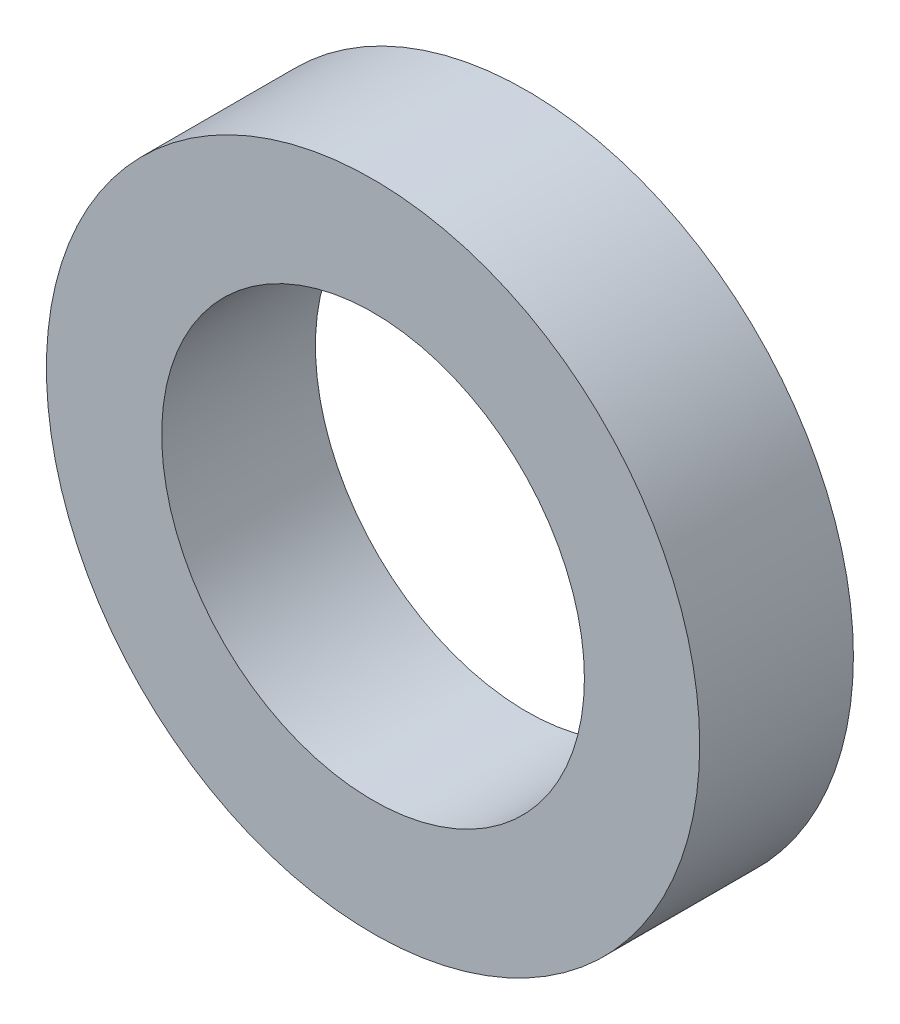
ISO-10303-21;
HEADER;
FILE_DESCRIPTION(('STEP AP214'),'2;1');
FILE_NAME('part.step','',(''),(''),'','','');
FILE_SCHEMA(('AUTOMOTIVE_DESIGN { 1 0 10303 214 1 1 1 1 }'));
ENDSEC;
DATA;
#1=APPLICATION_CONTEXT('core data for automotive mechanical design processes');
#2=APPLICATION_PROTOCOL_DEFINITION('international standard','automotive_design',2000,#1);
#3=PRODUCT_CONTEXT('',#1,'mechanical');
#4=PRODUCT('Part','Part','',(#3));
#5=PRODUCT_RELATED_PRODUCT_CATEGORY('part','',(#4));
#6=PRODUCT_DEFINITION_FORMATION('','',#4);
#7=PRODUCT_DEFINITION_CONTEXT('part definition',#1,'design');
#8=PRODUCT_DEFINITION('design','',#6,#7);
#9=PRODUCT_DEFINITION_SHAPE('','',#8);
#10=(LENGTH_UNIT() NAMED_UNIT(*) SI_UNIT(.MILLI.,.METRE.));
#11=(NAMED_UNIT(*) PLANE_ANGLE_UNIT() SI_UNIT($,.RADIAN.));
#12=(NAMED_UNIT(*) SI_UNIT($,.STERADIAN.) SOLID_ANGLE_UNIT());
#13=UNCERTAINTY_MEASURE_WITH_UNIT(LENGTH_MEASURE(1.E-05),#10,'distance_accuracy_value','');
#14=(GEOMETRIC_REPRESENTATION_CONTEXT(3) GLOBAL_UNCERTAINTY_ASSIGNED_CONTEXT((#13)) GLOBAL_UNIT_ASSIGNED_CONTEXT((#10,
#11,#12)) REPRESENTATION_CONTEXT('',''));
#15=CARTESIAN_POINT('',(0.,0.,0.));
#16=DIRECTION('',(0.,0.,1.));
#17=DIRECTION('',(1.,0.,0.));
#18=AXIS2_PLACEMENT_3D('',#15,#16,#17);
#19=CARTESIAN_POINT('',(0.,0.,2.));
#20=DIRECTION('',(0.,0.,1.));
#21=DIRECTION('',(1.,0.,0.));
#22=AXIS2_PLACEMENT_3D('',#19,#20,#21);
#23=PLANE('',#22);
#24=CARTESIAN_POINT('',(0.,0.,2.));
#25=DIRECTION('',(0.,0.,1.));
#26=DIRECTION('',(1.,0.,0.));
#27=AXIS2_PLACEMENT_3D('',#24,#25,#26);
#28=CIRCLE('',#27,4.25);
#29=CARTESIAN_POINT('',(4.25,0.,2.));
#30=VERTEX_POINT('',#29);
#31=EDGE_CURVE('E10',#30,#30,#28,.T.);
#32=ORIENTED_EDGE('',*,*,#31,.T.);
#33=EDGE_LOOP('',(#32));
#34=FACE_BOUND('',#33,.T.);
#35=CARTESIAN_POINT('',(0.,0.,2.));
#36=DIRECTION('',(0.,0.,1.));
#37=DIRECTION('',(1.,0.,0.));
#38=AXIS2_PLACEMENT_3D('',#35,#36,#37);
#39=CIRCLE('',#38,2.75);
#40=CARTESIAN_POINT('',(2.75,0.,2.));
#41=VERTEX_POINT('',#40);
#42=EDGE_CURVE('E42',#41,#41,#39,.T.);
#43=ORIENTED_EDGE('',*,*,#42,.F.);
#44=EDGE_LOOP('',(#43));
#45=FACE_BOUND('',#44,.T.);
#46=ADVANCED_FACE('F31',(#34,#45),#23,.T.);
#47=CARTESIAN_POINT('',(0.,0.,0.));
#48=DIRECTION('',(0.,0.,1.));
#49=DIRECTION('',(1.,0.,0.));
#50=AXIS2_PLACEMENT_3D('',#47,#48,#49);
#51=PLANE('',#50);
#52=CARTESIAN_POINT('',(0.,0.,0.));
#53=DIRECTION('',(0.,0.,1.));
#54=DIRECTION('',(1.,0.,0.));
#55=AXIS2_PLACEMENT_3D('',#52,#53,#54);
#56=CIRCLE('',#55,4.25);
#57=CARTESIAN_POINT('',(4.25,0.,0.));
#58=VERTEX_POINT('',#57);
#59=EDGE_CURVE('E35',#58,#58,#56,.T.);
#60=ORIENTED_EDGE('',*,*,#59,.F.);
#61=EDGE_LOOP('',(#60));
#62=FACE_BOUND('',#61,.T.);
#63=CARTESIAN_POINT('',(0.,0.,0.));
#64=DIRECTION('',(0.,0.,1.));
#65=DIRECTION('',(1.,0.,0.));
#66=AXIS2_PLACEMENT_3D('',#63,#64,#65);
#67=CIRCLE('',#66,2.75);
#68=CARTESIAN_POINT('',(2.75,0.,0.));
#69=VERTEX_POINT('',#68);
#70=EDGE_CURVE('E44',#69,#69,#67,.T.);
#71=ORIENTED_EDGE('',*,*,#70,.T.);
#72=EDGE_LOOP('',(#71));
#73=FACE_BOUND('',#72,.T.);
#74=ADVANCED_FACE('F54',(#62,#73),#51,.F.);
#75=CARTESIAN_POINT('',(0.,0.,2.));
#76=DIRECTION('',(0.,0.,-1.));
#77=DIRECTION('',(-1.,0.,0.));
#78=AXIS2_PLACEMENT_3D('',#75,#76,#77);
#79=CYLINDRICAL_SURFACE('',#78,4.25);
#80=ORIENTED_EDGE('',*,*,#31,.F.);
#81=EDGE_LOOP('',(#80));
#82=FACE_BOUND('',#81,.T.);
#83=ORIENTED_EDGE('',*,*,#59,.T.);
#84=EDGE_LOOP('',(#83));
#85=FACE_BOUND('',#84,.T.);
#86=ADVANCED_FACE('F33',(#82,#85),#79,.T.);
#87=CARTESIAN_POINT('',(0.,0.,2.));
#88=DIRECTION('',(0.,0.,-1.));
#89=DIRECTION('',(-1.,0.,0.));
#90=AXIS2_PLACEMENT_3D('',#87,#88,#89);
#91=CYLINDRICAL_SURFACE('',#90,2.75);
#92=ORIENTED_EDGE('',*,*,#42,.T.);
#93=EDGE_LOOP('',(#92));
#94=FACE_BOUND('',#93,.T.);
#95=ORIENTED_EDGE('',*,*,#70,.F.);
#96=EDGE_LOOP('',(#95));
#97=FACE_BOUND('',#96,.T.);
#98=ADVANCED_FACE('F50',(#94,#97),#91,.F.);
#99=CLOSED_SHELL('',(#46,#74,#86,#98));
#100=MANIFOLD_SOLID_BREP('B2',#99);
#101=ADVANCED_BREP_SHAPE_REPRESENTATION('',(#18,#100),#14);
#102=SHAPE_DEFINITION_REPRESENTATION(#9,#101);
ENDSEC;
END-ISO-10303-21;
